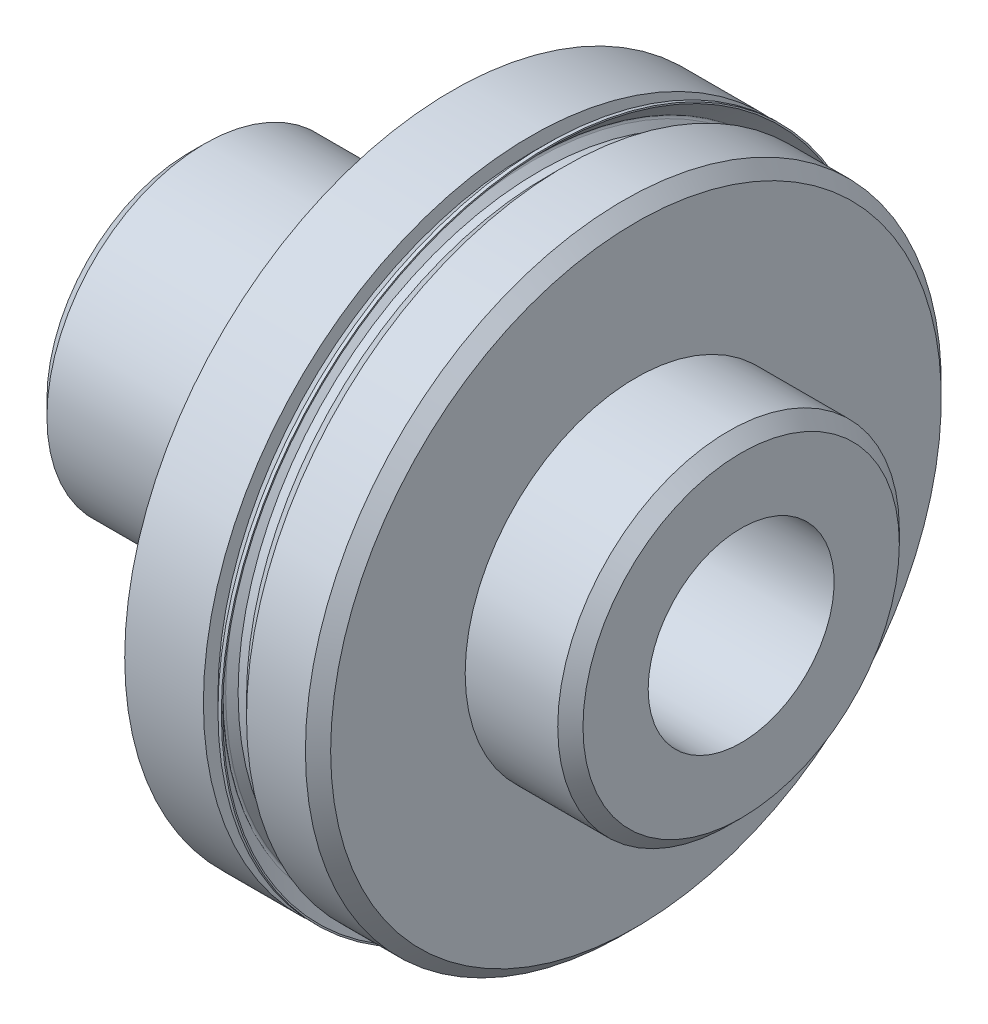
ISO-10303-21;
HEADER;
FILE_DESCRIPTION(('STEP AP214'),'2;1');
FILE_NAME('part.step','',(''),(''),'','','');
FILE_SCHEMA(('AUTOMOTIVE_DESIGN { 1 0 10303 214 1 1 1 1 }'));
ENDSEC;
DATA;
#1=APPLICATION_CONTEXT('core data for automotive mechanical design processes');
#2=APPLICATION_PROTOCOL_DEFINITION('international standard','automotive_design',2000,#1);
#3=PRODUCT_CONTEXT('',#1,'mechanical');
#4=PRODUCT('Part','Part','',(#3));
#5=PRODUCT_RELATED_PRODUCT_CATEGORY('part','',(#4));
#6=PRODUCT_DEFINITION_FORMATION('','',#4);
#7=PRODUCT_DEFINITION_CONTEXT('part definition',#1,'design');
#8=PRODUCT_DEFINITION('design','',#6,#7);
#9=PRODUCT_DEFINITION_SHAPE('','',#8);
#10=(LENGTH_UNIT() NAMED_UNIT(*) SI_UNIT(.MILLI.,.METRE.));
#11=(NAMED_UNIT(*) PLANE_ANGLE_UNIT() SI_UNIT($,.RADIAN.));
#12=(NAMED_UNIT(*) SI_UNIT($,.STERADIAN.) SOLID_ANGLE_UNIT());
#13=UNCERTAINTY_MEASURE_WITH_UNIT(LENGTH_MEASURE(1.E-05),#10,'distance_accuracy_value','');
#14=(GEOMETRIC_REPRESENTATION_CONTEXT(3) GLOBAL_UNCERTAINTY_ASSIGNED_CONTEXT((#13)) GLOBAL_UNIT_ASSIGNED_CONTEXT((#10,
#11,#12)) REPRESENTATION_CONTEXT('',''));
#15=CARTESIAN_POINT('',(0.,0.,0.));
#16=DIRECTION('',(0.,0.,1.));
#17=DIRECTION('',(1.,0.,0.));
#18=AXIS2_PLACEMENT_3D('',#15,#16,#17);
#19=CARTESIAN_POINT('',(20.6248,19.76755,0.));
#20=DIRECTION('',(-1.,0.,0.));
#21=DIRECTION('',(0.,0.,1.));
#22=AXIS2_PLACEMENT_3D('',#19,#20,#21);
#23=PLANE('',#22);
#24=CARTESIAN_POINT('',(20.6248,0.,0.));
#25=DIRECTION('',(-1.,0.,0.));
#26=DIRECTION('',(0.,0.,1.));
#27=AXIS2_PLACEMENT_3D('',#24,#25,#26);
#28=CIRCLE('',#27,19.76755);
#29=CARTESIAN_POINT('',(20.6248,0.,19.76755));
#30=VERTEX_POINT('',#29);
#31=EDGE_CURVE('E81',#30,#30,#28,.T.);
#32=ORIENTED_EDGE('',*,*,#31,.F.);
#33=EDGE_LOOP('',(#32));
#34=FACE_BOUND('',#33,.T.);
#35=CARTESIAN_POINT('',(20.6248,0.,0.));
#36=DIRECTION('',(-1.,0.,0.));
#37=DIRECTION('',(0.,0.,1.));
#38=AXIS2_PLACEMENT_3D('',#35,#36,#37);
#39=CIRCLE('',#38,18.888259175245);
#40=CARTESIAN_POINT('',(20.6248,0.,18.888259175245));
#41=VERTEX_POINT('',#40);
#42=EDGE_CURVE('E10',#41,#41,#39,.F.);
#43=ORIENTED_EDGE('',*,*,#42,.F.);
#44=EDGE_LOOP('',(#43));
#45=FACE_BOUND('',#44,.T.);
#46=ADVANCED_FACE('F34',(#34,#45),#23,.F.);
#47=CARTESIAN_POINT('',(26.9748,0.,0.));
#48=DIRECTION('',(-1.,0.,0.));
#49=DIRECTION('',(0.,0.,1.));
#50=AXIS2_PLACEMENT_3D('',#47,#48,#49);
#51=CYLINDRICAL_SURFACE('',#50,18.18005);
#52=CARTESIAN_POINT('',(21.6408,0.,0.));
#53=DIRECTION('',(-1.,0.,0.));
#54=DIRECTION('',(0.,0.,1.));
#55=AXIS2_PLACEMENT_3D('',#52,#53,#54);
#56=CIRCLE('',#55,18.18005);
#57=CARTESIAN_POINT('',(21.6408,0.,18.18005));
#58=VERTEX_POINT('',#57);
#59=EDGE_CURVE('E84',#58,#58,#56,.T.);
#60=ORIENTED_EDGE('',*,*,#59,.T.);
#61=EDGE_LOOP('',(#60));
#62=FACE_BOUND('',#61,.T.);
#63=CARTESIAN_POINT('',(21.1328,0.,0.));
#64=DIRECTION('',(-1.,0.,0.));
#65=DIRECTION('',(0.,0.,1.));
#66=AXIS2_PLACEMENT_3D('',#63,#64,#65);
#67=CIRCLE('',#66,18.18005);
#68=CARTESIAN_POINT('',(21.1328,0.,18.18005));
#69=VERTEX_POINT('',#68);
#70=EDGE_CURVE('E41',#69,#69,#67,.T.);
#71=ORIENTED_EDGE('',*,*,#70,.F.);
#72=EDGE_LOOP('',(#71));
#73=FACE_BOUND('',#72,.T.);
#74=ADVANCED_FACE('F139',(#62,#73),#51,.T.);
#75=CARTESIAN_POINT('',(26.9748,18.43405,0.));
#76=DIRECTION('',(-1.,0.,0.));
#77=DIRECTION('',(0.,0.,1.));
#78=AXIS2_PLACEMENT_3D('',#75,#76,#77);
#79=PLANE('',#78);
#80=CARTESIAN_POINT('',(26.9748,0.,0.));
#81=DIRECTION('',(-1.,0.,0.));
#82=DIRECTION('',(0.,0.,1.));
#83=AXIS2_PLACEMENT_3D('',#80,#81,#82);
#84=CIRCLE('',#83,18.43405);
#85=CARTESIAN_POINT('',(26.9748,0.,18.43405));
#86=VERTEX_POINT('',#85);
#87=EDGE_CURVE('E93',#86,#86,#84,.T.);
#88=ORIENTED_EDGE('',*,*,#87,.F.);
#89=EDGE_LOOP('',(#88));
#90=FACE_BOUND('',#89,.T.);
#91=CARTESIAN_POINT('',(26.9748,0.,0.));
#92=DIRECTION('',(-1.,0.,0.));
#93=DIRECTION('',(0.,0.,1.));
#94=AXIS2_PLACEMENT_3D('',#91,#92,#93);
#95=CIRCLE('',#94,10.3124);
#96=CARTESIAN_POINT('',(26.9748,0.,10.3124));
#97=VERTEX_POINT('',#96);
#98=EDGE_CURVE('E45',#97,#97,#95,.F.);
#99=ORIENTED_EDGE('',*,*,#98,.F.);
#100=EDGE_LOOP('',(#99));
#101=FACE_BOUND('',#100,.T.);
#102=ADVANCED_FACE('F145',(#90,#101),#79,.F.);
#103=CARTESIAN_POINT('',(15.875,0.,0.));
#104=DIRECTION('',(-1.,0.,0.));
#105=DIRECTION('',(0.,0.,1.));
#106=AXIS2_PLACEMENT_3D('',#103,#104,#105);
#107=CYLINDRICAL_SURFACE('',#106,9.49325);
#108=CARTESIAN_POINT('',(13.4874,0.,0.));
#109=DIRECTION('',(-1.,0.,0.));
#110=DIRECTION('',(0.,0.,1.));
#111=AXIS2_PLACEMENT_3D('',#108,#109,#110);
#112=CIRCLE('',#111,9.49325);
#113=CARTESIAN_POINT('',(13.4874,0.,9.49325));
#114=VERTEX_POINT('',#113);
#115=EDGE_CURVE('E49',#114,#114,#112,.T.);
#116=ORIENTED_EDGE('',*,*,#115,.F.);
#117=EDGE_LOOP('',(#116));
#118=FACE_BOUND('',#117,.T.);
#119=CARTESIAN_POINT('',(15.875,0.,0.));
#120=DIRECTION('',(1.,0.,0.));
#121=DIRECTION('',(0.,0.,-1.));
#122=AXIS2_PLACEMENT_3D('',#119,#120,#121);
#123=CIRCLE('',#122,9.49325);
#124=CARTESIAN_POINT('',(15.875,0.,-9.49325));
#125=VERTEX_POINT('',#124);
#126=EDGE_CURVE('E75',#125,#125,#123,.T.);
#127=ORIENTED_EDGE('',*,*,#126,.F.);
#128=EDGE_LOOP('',(#127));
#129=FACE_BOUND('',#128,.T.);
#130=ADVANCED_FACE('F36',(#118,#129),#107,.T.);
#131=CARTESIAN_POINT('',(13.4874,9.41705,0.));
#132=DIRECTION('',(1.,0.,0.));
#133=DIRECTION('',(0.,0.,-1.));
#134=AXIS2_PLACEMENT_3D('',#131,#132,#133);
#135=PLANE('',#134);
#136=CARTESIAN_POINT('',(13.4874,0.,0.));
#137=DIRECTION('',(-1.,0.,0.));
#138=DIRECTION('',(0.,0.,1.));
#139=AXIS2_PLACEMENT_3D('',#136,#137,#138);
#140=CIRCLE('',#139,9.41705);
#141=CARTESIAN_POINT('',(13.4874,0.,9.41705));
#142=VERTEX_POINT('',#141);
#143=EDGE_CURVE('E54',#142,#142,#140,.T.);
#144=ORIENTED_EDGE('',*,*,#143,.F.);
#145=EDGE_LOOP('',(#144));
#146=FACE_BOUND('',#145,.T.);
#147=ORIENTED_EDGE('',*,*,#115,.T.);
#148=EDGE_LOOP('',(#147));
#149=FACE_BOUND('',#148,.T.);
#150=ADVANCED_FACE('F187',(#146,#149),#135,.F.);
#151=CARTESIAN_POINT('',(12.3697999999999,0.,0.));
#152=DIRECTION('',(-1.,0.,0.));
#153=DIRECTION('',(0.,0.,1.));
#154=AXIS2_PLACEMENT_3D('',#151,#152,#153);
#155=TOROIDAL_SURFACE('',#154,9.41705000000012,1.11760000000012);
#156=CARTESIAN_POINT('',(12.3698,0.,0.));
#157=DIRECTION('',(-1.,0.,0.));
#158=DIRECTION('',(0.,0.,1.));
#159=AXIS2_PLACEMENT_3D('',#156,#157,#158);
#160=CIRCLE('',#159,8.29945);
#161=CARTESIAN_POINT('',(12.3698,0.,8.29945));
#162=VERTEX_POINT('',#161);
#163=EDGE_CURVE('E57',#162,#162,#160,.T.);
#164=ORIENTED_EDGE('',*,*,#163,.F.);
#165=EDGE_LOOP('',(#164));
#166=FACE_BOUND('',#165,.T.);
#167=ORIENTED_EDGE('',*,*,#143,.T.);
#168=EDGE_LOOP('',(#167));
#169=FACE_BOUND('',#168,.T.);
#170=ADVANCED_FACE('F184',(#166,#169),#155,.F.);
#171=CARTESIAN_POINT('',(15.875,0.,0.));
#172=DIRECTION('',(-1.,0.,0.));
#173=DIRECTION('',(0.,0.,1.));
#174=AXIS2_PLACEMENT_3D('',#171,#172,#173);
#175=CYLINDRICAL_SURFACE('',#174,8.29945);
#176=CARTESIAN_POINT('',(11.0362999999995,0.,0.));
#177=DIRECTION('',(-1.,0.,0.));
#178=DIRECTION('',(0.,0.,1.));
#179=AXIS2_PLACEMENT_3D('',#176,#177,#178);
#180=CIRCLE('',#179,8.29945);
#181=CARTESIAN_POINT('',(11.0362999999995,0.,8.29945));
#182=VERTEX_POINT('',#181);
#183=EDGE_CURVE('E60',#182,#182,#180,.T.);
#184=ORIENTED_EDGE('',*,*,#183,.F.);
#185=EDGE_LOOP('',(#184));
#186=FACE_BOUND('',#185,.T.);
#187=ORIENTED_EDGE('',*,*,#163,.T.);
#188=EDGE_LOOP('',(#187));
#189=FACE_BOUND('',#188,.T.);
#190=ADVANCED_FACE('F180',(#186,#189),#175,.T.);
#191=CARTESIAN_POINT('',(11.0362999999995,0.,0.));
#192=DIRECTION('',(-1.,0.,0.));
#193=DIRECTION('',(0.,0.,1.));
#194=AXIS2_PLACEMENT_3D('',#191,#192,#193);
#195=TOROIDAL_SURFACE('',#194,9.41704999999865,1.11759999999865);
#196=CARTESIAN_POINT('',(10.2623331868814,0.,0.));
#197=DIRECTION('',(-1.,0.,0.));
#198=DIRECTION('',(0.,0.,1.));
#199=AXIS2_PLACEMENT_3D('',#196,#197,#198);
#200=CIRCLE('',#199,8.6108210423267);
#201=CARTESIAN_POINT('',(10.2623331868814,0.,8.6108210423267));
#202=VERTEX_POINT('',#201);
#203=EDGE_CURVE('E63',#202,#202,#200,.T.);
#204=ORIENTED_EDGE('',*,*,#203,.F.);
#205=EDGE_LOOP('',(#204));
#206=FACE_BOUND('',#205,.T.);
#207=ORIENTED_EDGE('',*,*,#183,.T.);
#208=EDGE_LOOP('',(#207));
#209=FACE_BOUND('',#208,.T.);
#210=ADVANCED_FACE('F176',(#206,#209),#195,.F.);
#211=CARTESIAN_POINT('',(10.2623331868814,0.,0.));
#212=DIRECTION('',(-1.,0.,0.));
#213=DIRECTION('',(0.,0.,1.));
#214=AXIS2_PLACEMENT_3D('',#211,#212,#213);
#215=CONICAL_SURFACE('',#214,8.6108210423267,0.764984450361304);
#216=CARTESIAN_POINT('',(9.3100474613459,0.,0.));
#217=DIRECTION('',(-1.,0.,0.));
#218=DIRECTION('',(0.,0.,1.));
#219=AXIS2_PLACEMENT_3D('',#216,#217,#218);
#220=CIRCLE('',#219,9.525);
#221=CARTESIAN_POINT('',(9.3100474613459,0.,9.525));
#222=VERTEX_POINT('',#221);
#223=EDGE_CURVE('E66',#222,#222,#220,.T.);
#224=ORIENTED_EDGE('',*,*,#223,.F.);
#225=EDGE_LOOP('',(#224));
#226=FACE_BOUND('',#225,.T.);
#227=ORIENTED_EDGE('',*,*,#203,.T.);
#228=EDGE_LOOP('',(#227));
#229=FACE_BOUND('',#228,.T.);
#230=ADVANCED_FACE('F172',(#226,#229),#215,.T.);
#231=CARTESIAN_POINT('',(15.875,0.,0.));
#232=DIRECTION('',(-1.,0.,0.));
#233=DIRECTION('',(0.,0.,1.));
#234=AXIS2_PLACEMENT_3D('',#231,#232,#233);
#235=CYLINDRICAL_SURFACE('',#234,9.525);
#236=CARTESIAN_POINT('',(0.935989999999999,0.,0.));
#237=DIRECTION('',(-1.,0.,0.));
#238=DIRECTION('',(0.,0.,1.));
#239=AXIS2_PLACEMENT_3D('',#236,#237,#238);
#240=CIRCLE('',#239,9.525);
#241=CARTESIAN_POINT('',(0.935989999999999,0.,9.525));
#242=VERTEX_POINT('',#241);
#243=EDGE_CURVE('E69',#242,#242,#240,.T.);
#244=ORIENTED_EDGE('',*,*,#243,.F.);
#245=EDGE_LOOP('',(#244));
#246=FACE_BOUND('',#245,.T.);
#247=ORIENTED_EDGE('',*,*,#223,.T.);
#248=EDGE_LOOP('',(#247));
#249=FACE_BOUND('',#248,.T.);
#250=ADVANCED_FACE('F168',(#246,#249),#235,.T.);
#251=CARTESIAN_POINT('',(0.935989999999999,0.,0.));
#252=DIRECTION('',(1.,0.,0.));
#253=DIRECTION('',(0.,0.,-1.));
#254=AXIS2_PLACEMENT_3D('',#251,#252,#253);
#255=CONICAL_SURFACE('',#254,9.525,0.785398163397449);
#256=CARTESIAN_POINT('',(0.,0.,0.));
#257=DIRECTION('',(-1.,0.,0.));
#258=DIRECTION('',(0.,0.,1.));
#259=AXIS2_PLACEMENT_3D('',#256,#257,#258);
#260=CIRCLE('',#259,8.58901);
#261=CARTESIAN_POINT('',(0.,0.,8.58901));
#262=VERTEX_POINT('',#261);
#263=EDGE_CURVE('E72',#262,#262,#260,.T.);
#264=ORIENTED_EDGE('',*,*,#263,.F.);
#265=EDGE_LOOP('',(#264));
#266=FACE_BOUND('',#265,.T.);
#267=ORIENTED_EDGE('',*,*,#243,.T.);
#268=EDGE_LOOP('',(#267));
#269=FACE_BOUND('',#268,.T.);
#270=ADVANCED_FACE('F164',(#266,#269),#255,.T.);
#271=CARTESIAN_POINT('',(0.,0.,0.));
#272=DIRECTION('',(1.,0.,0.));
#273=DIRECTION('',(0.,0.,-1.));
#274=AXIS2_PLACEMENT_3D('',#271,#272,#273);
#275=PLANE('',#274);
#276=CARTESIAN_POINT('',(0.,0.,0.));
#277=DIRECTION('',(-1.,0.,0.));
#278=DIRECTION('',(0.,0.,1.));
#279=AXIS2_PLACEMENT_3D('',#276,#277,#278);
#280=CIRCLE('',#279,6.3754);
#281=CARTESIAN_POINT('',(0.,0.,6.3754));
#282=VERTEX_POINT('',#281);
#283=EDGE_CURVE('E108',#282,#282,#280,.T.);
#284=ORIENTED_EDGE('',*,*,#283,.F.);
#285=EDGE_LOOP('',(#284));
#286=FACE_BOUND('',#285,.T.);
#287=ORIENTED_EDGE('',*,*,#263,.T.);
#288=EDGE_LOOP('',(#287));
#289=FACE_BOUND('',#288,.T.);
#290=ADVANCED_FACE('F160',(#286,#289),#275,.F.);
#291=CARTESIAN_POINT('',(15.875,0.,0.));
#292=DIRECTION('',(1.,0.,0.));
#293=DIRECTION('',(0.,0.,-1.));
#294=AXIS2_PLACEMENT_3D('',#291,#292,#293);
#295=PLANE('',#294);
#296=CARTESIAN_POINT('',(15.875,0.,0.));
#297=DIRECTION('',(-1.,0.,0.));
#298=DIRECTION('',(0.,0.,1.));
#299=AXIS2_PLACEMENT_3D('',#296,#297,#298);
#300=CIRCLE('',#299,19.76755);
#301=CARTESIAN_POINT('',(15.875,0.,19.76755));
#302=VERTEX_POINT('',#301);
#303=EDGE_CURVE('E78',#302,#302,#300,.T.);
#304=ORIENTED_EDGE('',*,*,#303,.T.);
#305=EDGE_LOOP('',(#304));
#306=FACE_BOUND('',#305,.T.);
#307=ORIENTED_EDGE('',*,*,#126,.T.);
#308=EDGE_LOOP('',(#307));
#309=FACE_BOUND('',#308,.T.);
#310=ADVANCED_FACE('F156',(#306,#309),#295,.F.);
#311=CARTESIAN_POINT('',(26.9748,0.,0.));
#312=DIRECTION('',(-1.,0.,0.));
#313=DIRECTION('',(0.,0.,1.));
#314=AXIS2_PLACEMENT_3D('',#311,#312,#313);
#315=CYLINDRICAL_SURFACE('',#314,19.76755);
#316=ORIENTED_EDGE('',*,*,#303,.F.);
#317=EDGE_LOOP('',(#316));
#318=FACE_BOUND('',#317,.T.);
#319=ORIENTED_EDGE('',*,*,#31,.T.);
#320=EDGE_LOOP('',(#319));
#321=FACE_BOUND('',#320,.T.);
#322=ADVANCED_FACE('F152',(#318,#321),#315,.T.);
#323=CARTESIAN_POINT('',(22.6568,0.,0.));
#324=DIRECTION('',(1.,0.,0.));
#325=DIRECTION('',(0.,0.,-1.));
#326=AXIS2_PLACEMENT_3D('',#323,#324,#325);
#327=CONICAL_SURFACE('',#326,19.19605,0.785398163397445);
#328=ORIENTED_EDGE('',*,*,#59,.F.);
#329=EDGE_LOOP('',(#328));
#330=FACE_BOUND('',#329,.T.);
#331=CARTESIAN_POINT('',(22.6568,0.,0.));
#332=DIRECTION('',(-1.,0.,0.));
#333=DIRECTION('',(0.,0.,1.));
#334=AXIS2_PLACEMENT_3D('',#331,#332,#333);
#335=CIRCLE('',#334,19.19605);
#336=CARTESIAN_POINT('',(22.6568,0.,19.19605));
#337=VERTEX_POINT('',#336);
#338=EDGE_CURVE('E87',#337,#337,#335,.T.);
#339=ORIENTED_EDGE('',*,*,#338,.T.);
#340=EDGE_LOOP('',(#339));
#341=FACE_BOUND('',#340,.T.);
#342=ADVANCED_FACE('F155',(#330,#341),#327,.T.);
#343=CARTESIAN_POINT('',(26.9748,0.,0.));
#344=DIRECTION('',(-1.,0.,0.));
#345=DIRECTION('',(0.,0.,1.));
#346=AXIS2_PLACEMENT_3D('',#343,#344,#345);
#347=CYLINDRICAL_SURFACE('',#346,19.19605);
#348=ORIENTED_EDGE('',*,*,#338,.F.);
#349=EDGE_LOOP('',(#348));
#350=FACE_BOUND('',#349,.T.);
#351=CARTESIAN_POINT('',(26.2128,0.,0.));
#352=DIRECTION('',(-1.,0.,0.));
#353=DIRECTION('',(0.,0.,1.));
#354=AXIS2_PLACEMENT_3D('',#351,#352,#353);
#355=CIRCLE('',#354,19.19605);
#356=CARTESIAN_POINT('',(26.2128,0.,19.19605));
#357=VERTEX_POINT('',#356);
#358=EDGE_CURVE('E90',#357,#357,#355,.T.);
#359=ORIENTED_EDGE('',*,*,#358,.T.);
#360=EDGE_LOOP('',(#359));
#361=FACE_BOUND('',#360,.T.);
#362=ADVANCED_FACE('F218',(#350,#361),#347,.T.);
#363=CARTESIAN_POINT('',(26.9748,0.,0.));
#364=DIRECTION('',(-1.,0.,0.));
#365=DIRECTION('',(0.,0.,1.));
#366=AXIS2_PLACEMENT_3D('',#363,#364,#365);
#367=CONICAL_SURFACE('',#366,18.43405,0.785398163397448);
#368=ORIENTED_EDGE('',*,*,#358,.F.);
#369=EDGE_LOOP('',(#368));
#370=FACE_BOUND('',#369,.T.);
#371=ORIENTED_EDGE('',*,*,#87,.T.);
#372=EDGE_LOOP('',(#371));
#373=FACE_BOUND('',#372,.T.);
#374=ADVANCED_FACE('F215',(#370,#373),#367,.T.);
#375=CARTESIAN_POINT('',(33.3248,0.,0.));
#376=DIRECTION('',(-1.,0.,0.));
#377=DIRECTION('',(0.,0.,1.));
#378=AXIS2_PLACEMENT_3D('',#375,#376,#377);
#379=CYLINDRICAL_SURFACE('',#378,10.3124);
#380=ORIENTED_EDGE('',*,*,#98,.T.);
#381=EDGE_LOOP('',(#380));
#382=FACE_BOUND('',#381,.T.);
#383=CARTESIAN_POINT('',(32.5628,0.,0.));
#384=DIRECTION('',(-1.,0.,0.));
#385=DIRECTION('',(0.,0.,1.));
#386=AXIS2_PLACEMENT_3D('',#383,#384,#385);
#387=CIRCLE('',#386,10.3124);
#388=CARTESIAN_POINT('',(32.5628,0.,10.3124));
#389=VERTEX_POINT('',#388);
#390=EDGE_CURVE('E96',#389,#389,#387,.T.);
#391=ORIENTED_EDGE('',*,*,#390,.T.);
#392=EDGE_LOOP('',(#391));
#393=FACE_BOUND('',#392,.T.);
#394=ADVANCED_FACE('F213',(#382,#393),#379,.T.);
#395=CARTESIAN_POINT('',(33.3248,0.,0.));
#396=DIRECTION('',(-1.,0.,0.));
#397=DIRECTION('',(0.,0.,1.));
#398=AXIS2_PLACEMENT_3D('',#395,#396,#397);
#399=CONICAL_SURFACE('',#398,9.5504,0.78539816339745);
#400=ORIENTED_EDGE('',*,*,#390,.F.);
#401=EDGE_LOOP('',(#400));
#402=FACE_BOUND('',#401,.T.);
#403=CARTESIAN_POINT('',(33.3248,0.,0.));
#404=DIRECTION('',(-1.,0.,0.));
#405=DIRECTION('',(0.,0.,1.));
#406=AXIS2_PLACEMENT_3D('',#403,#404,#405);
#407=CIRCLE('',#406,9.5504);
#408=CARTESIAN_POINT('',(33.3248,0.,9.5504));
#409=VERTEX_POINT('',#408);
#410=EDGE_CURVE('E99',#409,#409,#407,.T.);
#411=ORIENTED_EDGE('',*,*,#410,.T.);
#412=EDGE_LOOP('',(#411));
#413=FACE_BOUND('',#412,.T.);
#414=ADVANCED_FACE('F253',(#402,#413),#399,.T.);
#415=CARTESIAN_POINT('',(33.3248,9.5504,0.));
#416=DIRECTION('',(-1.,0.,0.));
#417=DIRECTION('',(0.,0.,1.));
#418=AXIS2_PLACEMENT_3D('',#415,#416,#417);
#419=PLANE('',#418);
#420=CARTESIAN_POINT('',(33.3248,0.,0.));
#421=DIRECTION('',(-1.,0.,0.));
#422=DIRECTION('',(0.,0.,1.));
#423=AXIS2_PLACEMENT_3D('',#420,#421,#422);
#424=CIRCLE('',#423,5.6134);
#425=CARTESIAN_POINT('',(33.3248,0.,5.6134));
#426=VERTEX_POINT('',#425);
#427=EDGE_CURVE('E102',#426,#426,#424,.T.);
#428=ORIENTED_EDGE('',*,*,#427,.T.);
#429=EDGE_LOOP('',(#428));
#430=FACE_BOUND('',#429,.T.);
#431=ORIENTED_EDGE('',*,*,#410,.F.);
#432=EDGE_LOOP('',(#431));
#433=FACE_BOUND('',#432,.T.);
#434=ADVANCED_FACE('F262',(#430,#433),#419,.F.);
#435=CARTESIAN_POINT('',(0.,0.,0.));
#436=DIRECTION('',(-1.,0.,0.));
#437=DIRECTION('',(0.,0.,1.));
#438=AXIS2_PLACEMENT_3D('',#435,#436,#437);
#439=CYLINDRICAL_SURFACE('',#438,5.6134);
#440=ORIENTED_EDGE('',*,*,#427,.F.);
#441=EDGE_LOOP('',(#440));
#442=FACE_BOUND('',#441,.T.);
#443=CARTESIAN_POINT('',(0.761999999999992,0.,0.));
#444=DIRECTION('',(-1.,0.,0.));
#445=DIRECTION('',(0.,0.,1.));
#446=AXIS2_PLACEMENT_3D('',#443,#444,#445);
#447=CIRCLE('',#446,5.6134);
#448=CARTESIAN_POINT('',(0.761999999999992,0.,5.6134));
#449=VERTEX_POINT('',#448);
#450=EDGE_CURVE('E105',#449,#449,#447,.T.);
#451=ORIENTED_EDGE('',*,*,#450,.T.);
#452=EDGE_LOOP('',(#451));
#453=FACE_BOUND('',#452,.T.);
#454=ADVANCED_FACE('F269',(#442,#453),#439,.F.);
#455=CARTESIAN_POINT('',(0.,0.,0.));
#456=DIRECTION('',(-1.,0.,0.));
#457=DIRECTION('',(0.,0.,1.));
#458=AXIS2_PLACEMENT_3D('',#455,#456,#457);
#459=CONICAL_SURFACE('',#458,6.3754,0.78539816339745);
#460=ORIENTED_EDGE('',*,*,#450,.F.);
#461=EDGE_LOOP('',(#460));
#462=FACE_BOUND('',#461,.T.);
#463=ORIENTED_EDGE('',*,*,#283,.T.);
#464=EDGE_LOOP('',(#463));
#465=FACE_BOUND('',#464,.T.);
#466=ADVANCED_FACE('F278',(#462,#465),#459,.F.);
#467=CARTESIAN_POINT('',(21.504090824755,0.,0.));
#468=DIRECTION('',(1.,0.,0.));
#469=DIRECTION('',(0.,0.,-1.));
#470=AXIS2_PLACEMENT_3D('',#467,#468,#469);
#471=CONICAL_SURFACE('',#470,19.76755,0.78539816339745);
#472=ORIENTED_EDGE('',*,*,#42,.T.);
#473=EDGE_LOOP('',(#472));
#474=FACE_BOUND('',#473,.T.);
#475=CARTESIAN_POINT('',(21.504090824755,0.,0.));
#476=DIRECTION('',(-1.,0.,0.));
#477=DIRECTION('',(0.,0.,1.));
#478=AXIS2_PLACEMENT_3D('',#475,#476,#477);
#479=CIRCLE('',#478,19.76755);
#480=CARTESIAN_POINT('',(21.504090824755,0.,19.76755));
#481=VERTEX_POINT('',#480);
#482=EDGE_CURVE('E111',#481,#481,#479,.T.);
#483=ORIENTED_EDGE('',*,*,#482,.T.);
#484=EDGE_LOOP('',(#483));
#485=FACE_BOUND('',#484,.T.);
#486=ADVANCED_FACE('F286',(#474,#485),#471,.T.);
#487=CARTESIAN_POINT('',(21.6408,0.,0.));
#488=DIRECTION('',(-1.,0.,0.));
#489=DIRECTION('',(0.,0.,1.));
#490=AXIS2_PLACEMENT_3D('',#487,#488,#489);
#491=CYLINDRICAL_SURFACE('',#490,19.76755);
#492=ORIENTED_EDGE('',*,*,#482,.F.);
#493=EDGE_LOOP('',(#492));
#494=FACE_BOUND('',#493,.T.);
#495=CARTESIAN_POINT('',(21.707290824755,0.,0.));
#496=DIRECTION('',(-1.,0.,0.));
#497=DIRECTION('',(0.,0.,1.));
#498=AXIS2_PLACEMENT_3D('',#495,#496,#497);
#499=CIRCLE('',#498,19.76755);
#500=CARTESIAN_POINT('',(21.707290824755,0.,19.76755));
#501=VERTEX_POINT('',#500);
#502=EDGE_CURVE('E114',#501,#501,#499,.T.);
#503=ORIENTED_EDGE('',*,*,#502,.T.);
#504=EDGE_LOOP('',(#503));
#505=FACE_BOUND('',#504,.T.);
#506=ADVANCED_FACE('F293',(#494,#505),#491,.T.);
#507=CARTESIAN_POINT('',(21.707290824755,19.683381804126,0.));
#508=DIRECTION('',(-1.,0.,0.));
#509=DIRECTION('',(0.,0.,1.));
#510=AXIS2_PLACEMENT_3D('',#507,#508,#509);
#511=PLANE('',#510);
#512=ORIENTED_EDGE('',*,*,#502,.F.);
#513=EDGE_LOOP('',(#512));
#514=FACE_BOUND('',#513,.T.);
#515=CARTESIAN_POINT('',(21.707290824755,0.,0.));
#516=DIRECTION('',(-1.,0.,0.));
#517=DIRECTION('',(0.,0.,1.));
#518=AXIS2_PLACEMENT_3D('',#515,#516,#517);
#519=CIRCLE('',#518,19.683381804126);
#520=CARTESIAN_POINT('',(21.707290824755,0.,19.683381804126));
#521=VERTEX_POINT('',#520);
#522=EDGE_CURVE('E117',#521,#521,#519,.T.);
#523=ORIENTED_EDGE('',*,*,#522,.T.);
#524=EDGE_LOOP('',(#523));
#525=FACE_BOUND('',#524,.T.);
#526=ADVANCED_FACE('F300',(#514,#525),#511,.F.);
#527=CARTESIAN_POINT('',(20.7581820715254,0.,0.));
#528=DIRECTION('',(1.,0.,0.));
#529=DIRECTION('',(0.,0.,-1.));
#530=AXIS2_PLACEMENT_3D('',#527,#528,#529);
#531=CONICAL_SURFACE('',#530,18.7342730508964,0.78539816339745);
#532=ORIENTED_EDGE('',*,*,#522,.F.);
#533=EDGE_LOOP('',(#532));
#534=FACE_BOUND('',#533,.T.);
#535=CARTESIAN_POINT('',(20.7581820715254,0.,0.));
#536=DIRECTION('',(-1.,0.,0.));
#537=DIRECTION('',(0.,0.,1.));
#538=AXIS2_PLACEMENT_3D('',#535,#536,#537);
#539=CIRCLE('',#538,18.7342730508964);
#540=CARTESIAN_POINT('',(20.7581820715254,0.,18.7342730508964));
#541=VERTEX_POINT('',#540);
#542=EDGE_CURVE('E120',#541,#541,#539,.T.);
#543=ORIENTED_EDGE('',*,*,#542,.T.);
#544=EDGE_LOOP('',(#543));
#545=FACE_BOUND('',#544,.T.);
#546=ADVANCED_FACE('F135',(#534,#545),#531,.F.);
#547=CARTESIAN_POINT('',(20.8479846327363,0.,0.));
#548=DIRECTION('',(-1.,0.,0.));
#549=DIRECTION('',(0.,0.,1.));
#550=AXIS2_PLACEMENT_3D('',#547,#548,#549);
#551=TOROIDAL_SURFACE('',#550,18.6444704896855,0.127000000000286);
#552=ORIENTED_EDGE('',*,*,#542,.F.);
#553=EDGE_LOOP('',(#552));
#554=FACE_BOUND('',#553,.T.);
#555=CARTESIAN_POINT('',(20.7581820715254,0.,0.));
#556=DIRECTION('',(-1.,0.,0.));
#557=DIRECTION('',(0.,0.,1.));
#558=AXIS2_PLACEMENT_3D('',#555,#556,#557);
#559=CIRCLE('',#558,18.5546679284746);
#560=CARTESIAN_POINT('',(20.7581820715254,0.,18.5546679284746));
#561=VERTEX_POINT('',#560);
#562=EDGE_CURVE('E123',#561,#561,#559,.T.);
#563=ORIENTED_EDGE('',*,*,#562,.T.);
#564=EDGE_LOOP('',(#563));
#565=FACE_BOUND('',#564,.T.);
#566=ADVANCED_FACE('F127',(#554,#565),#551,.F.);
#567=CARTESIAN_POINT('',(21.1328,0.,0.));
#568=DIRECTION('',(-1.,0.,0.));
#569=DIRECTION('',(0.,0.,1.));
#570=AXIS2_PLACEMENT_3D('',#567,#568,#569);
#571=CONICAL_SURFACE('',#570,18.18005,0.785398163397458);
#572=ORIENTED_EDGE('',*,*,#562,.F.);
#573=EDGE_LOOP('',(#572));
#574=FACE_BOUND('',#573,.T.);
#575=ORIENTED_EDGE('',*,*,#70,.T.);
#576=EDGE_LOOP('',(#575));
#577=FACE_BOUND('',#576,.T.);
#578=ADVANCED_FACE('F129',(#574,#577),#571,.T.);
#579=CLOSED_SHELL('',(#46,#74,#102,#130,#150,#170,#190,#210,#230,#250,#270,#290,#310,#322,#342,
#362,#374,#394,#414,#434,#454,#466,#486,#506,#526,#546,#566,#578));
#580=MANIFOLD_SOLID_BREP('B2',#579);
#581=ADVANCED_BREP_SHAPE_REPRESENTATION('',(#18,#580),#14);
#582=SHAPE_DEFINITION_REPRESENTATION(#9,#581);
ENDSEC;
END-ISO-10303-21;
